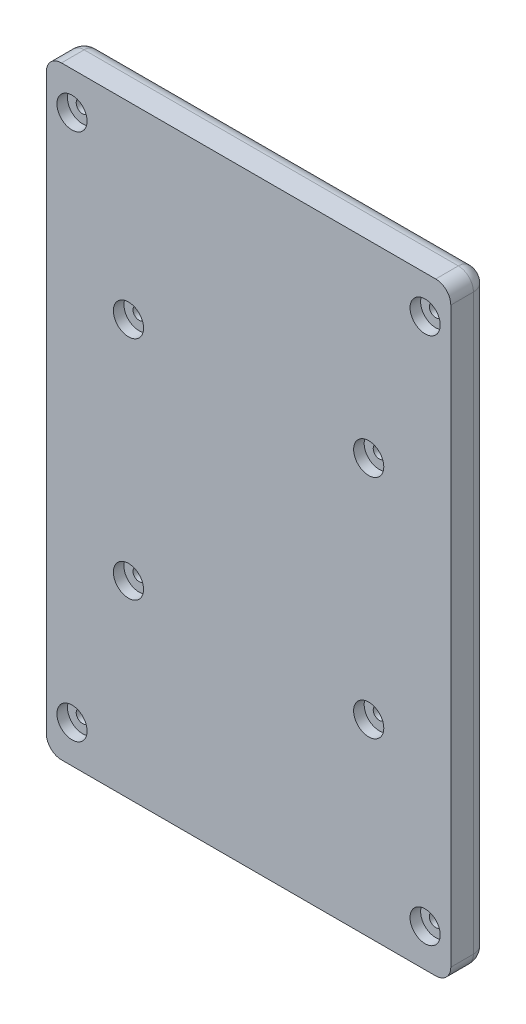
ISO-10303-21;
HEADER;
FILE_DESCRIPTION(('STEP AP214'),'2;1');
FILE_NAME('part.step','',(''),(''),'','','');
FILE_SCHEMA(('AUTOMOTIVE_DESIGN { 1 0 10303 214 1 1 1 1 }'));
ENDSEC;
DATA;
#1=APPLICATION_CONTEXT('core data for automotive mechanical design processes');
#2=APPLICATION_PROTOCOL_DEFINITION('international standard','automotive_design',2000,#1);
#3=PRODUCT_CONTEXT('',#1,'mechanical');
#4=PRODUCT('Part','Part','',(#3));
#5=PRODUCT_RELATED_PRODUCT_CATEGORY('part','',(#4));
#6=PRODUCT_DEFINITION_FORMATION('','',#4);
#7=PRODUCT_DEFINITION_CONTEXT('part definition',#1,'design');
#8=PRODUCT_DEFINITION('design','',#6,#7);
#9=PRODUCT_DEFINITION_SHAPE('','',#8);
#10=(LENGTH_UNIT() NAMED_UNIT(*) SI_UNIT(.MILLI.,.METRE.));
#11=(NAMED_UNIT(*) PLANE_ANGLE_UNIT() SI_UNIT($,.RADIAN.));
#12=(NAMED_UNIT(*) SI_UNIT($,.STERADIAN.) SOLID_ANGLE_UNIT());
#13=UNCERTAINTY_MEASURE_WITH_UNIT(LENGTH_MEASURE(1.E-05),#10,'distance_accuracy_value','');
#14=(GEOMETRIC_REPRESENTATION_CONTEXT(3) GLOBAL_UNCERTAINTY_ASSIGNED_CONTEXT((#13)) GLOBAL_UNIT_ASSIGNED_CONTEXT((#10,
#11,#12)) REPRESENTATION_CONTEXT('',''));
#15=CARTESIAN_POINT('',(0.,0.,0.));
#16=DIRECTION('',(0.,0.,1.));
#17=DIRECTION('',(1.,0.,0.));
#18=AXIS2_PLACEMENT_3D('',#15,#16,#17);
#19=CARTESIAN_POINT('',(54.4050000000001,125.,25.));
#20=DIRECTION('',(0.,0.,-1.));
#21=DIRECTION('',(-1.,0.,0.));
#22=AXIS2_PLACEMENT_3D('',#19,#20,#21);
#23=CYLINDRICAL_SURFACE('',#22,4.00000000000001);
#24=CARTESIAN_POINT('',(54.4050000000001,125.,0.));
#25=DIRECTION('',(0.,0.,1.));
#26=DIRECTION('',(1.,0.,0.));
#27=AXIS2_PLACEMENT_3D('',#24,#25,#26);
#28=CIRCLE('',#27,4.00000000000001);
#29=CARTESIAN_POINT('',(58.4050000000001,125.,0.));
#30=VERTEX_POINT('',#29);
#31=EDGE_CURVE('E240',#30,#30,#28,.T.);
#32=ORIENTED_EDGE('',*,*,#31,.F.);
#33=EDGE_LOOP('',(#32));
#34=FACE_BOUND('',#33,.T.);
#35=CARTESIAN_POINT('',(54.4050000000001,125.,18.));
#36=DIRECTION('',(0.,0.,1.));
#37=DIRECTION('',(1.,0.,0.));
#38=AXIS2_PLACEMENT_3D('',#35,#36,#37);
#39=CIRCLE('',#38,4.00000000000001);
#40=CARTESIAN_POINT('',(58.4050000000001,125.,18.));
#41=VERTEX_POINT('',#40);
#42=EDGE_CURVE('E215',#41,#41,#39,.T.);
#43=ORIENTED_EDGE('',*,*,#42,.T.);
#44=EDGE_LOOP('',(#43));
#45=FACE_BOUND('',#44,.T.);
#46=ADVANCED_FACE('F34',(#34,#45),#23,.F.);
#47=CARTESIAN_POINT('',(213.605,125.,25.));
#48=DIRECTION('',(0.,0.,-1.));
#49=DIRECTION('',(-1.,0.,0.));
#50=AXIS2_PLACEMENT_3D('',#47,#48,#49);
#51=CYLINDRICAL_SURFACE('',#50,3.99999999999999);
#52=CARTESIAN_POINT('',(213.605,125.,0.));
#53=DIRECTION('',(0.,0.,1.));
#54=DIRECTION('',(1.,0.,0.));
#55=AXIS2_PLACEMENT_3D('',#52,#53,#54);
#56=CIRCLE('',#55,3.99999999999999);
#57=CARTESIAN_POINT('',(217.605,125.,0.));
#58=VERTEX_POINT('',#57);
#59=EDGE_CURVE('E243',#58,#58,#56,.T.);
#60=ORIENTED_EDGE('',*,*,#59,.F.);
#61=EDGE_LOOP('',(#60));
#62=FACE_BOUND('',#61,.T.);
#63=CARTESIAN_POINT('',(213.605,125.,18.));
#64=DIRECTION('',(0.,0.,1.));
#65=DIRECTION('',(1.,0.,0.));
#66=AXIS2_PLACEMENT_3D('',#63,#64,#65);
#67=CIRCLE('',#66,3.99999999999999);
#68=CARTESIAN_POINT('',(217.605,125.,18.));
#69=VERTEX_POINT('',#68);
#70=EDGE_CURVE('E222',#69,#69,#67,.T.);
#71=ORIENTED_EDGE('',*,*,#70,.T.);
#72=EDGE_LOOP('',(#71));
#73=FACE_BOUND('',#72,.T.);
#74=ADVANCED_FACE('F284',(#62,#73),#51,.F.);
#75=CARTESIAN_POINT('',(213.605,275.,25.));
#76=DIRECTION('',(0.,0.,-1.));
#77=DIRECTION('',(-1.,0.,0.));
#78=AXIS2_PLACEMENT_3D('',#75,#76,#77);
#79=CYLINDRICAL_SURFACE('',#78,3.99999999999999);
#80=CARTESIAN_POINT('',(213.605,275.,0.));
#81=DIRECTION('',(0.,0.,1.));
#82=DIRECTION('',(1.,0.,0.));
#83=AXIS2_PLACEMENT_3D('',#80,#81,#82);
#84=CIRCLE('',#83,3.99999999999999);
#85=CARTESIAN_POINT('',(217.605,275.,0.));
#86=VERTEX_POINT('',#85);
#87=EDGE_CURVE('E246',#86,#86,#84,.T.);
#88=ORIENTED_EDGE('',*,*,#87,.F.);
#89=EDGE_LOOP('',(#88));
#90=FACE_BOUND('',#89,.T.);
#91=CARTESIAN_POINT('',(213.605,275.,18.));
#92=DIRECTION('',(0.,0.,1.));
#93=DIRECTION('',(1.,0.,0.));
#94=AXIS2_PLACEMENT_3D('',#91,#92,#93);
#95=CIRCLE('',#94,3.99999999999999);
#96=CARTESIAN_POINT('',(217.605,275.,18.));
#97=VERTEX_POINT('',#96);
#98=EDGE_CURVE('E229',#97,#97,#95,.T.);
#99=ORIENTED_EDGE('',*,*,#98,.T.);
#100=EDGE_LOOP('',(#99));
#101=FACE_BOUND('',#100,.T.);
#102=ADVANCED_FACE('F290',(#90,#101),#79,.F.);
#103=CARTESIAN_POINT('',(54.405,275.,25.));
#104=DIRECTION('',(0.,0.,-1.));
#105=DIRECTION('',(-1.,0.,0.));
#106=AXIS2_PLACEMENT_3D('',#103,#104,#105);
#107=CYLINDRICAL_SURFACE('',#106,4.00000000000001);
#108=CARTESIAN_POINT('',(54.405,275.,0.));
#109=DIRECTION('',(0.,0.,1.));
#110=DIRECTION('',(1.,0.,0.));
#111=AXIS2_PLACEMENT_3D('',#108,#109,#110);
#112=CIRCLE('',#111,4.00000000000001);
#113=CARTESIAN_POINT('',(58.405,275.,0.));
#114=VERTEX_POINT('',#113);
#115=EDGE_CURVE('E249',#114,#114,#112,.T.);
#116=ORIENTED_EDGE('',*,*,#115,.F.);
#117=EDGE_LOOP('',(#116));
#118=FACE_BOUND('',#117,.T.);
#119=CARTESIAN_POINT('',(54.405,275.,18.));
#120=DIRECTION('',(0.,0.,1.));
#121=DIRECTION('',(1.,0.,0.));
#122=AXIS2_PLACEMENT_3D('',#119,#120,#121);
#123=CIRCLE('',#122,4.00000000000001);
#124=CARTESIAN_POINT('',(58.405,275.,18.));
#125=VERTEX_POINT('',#124);
#126=EDGE_CURVE('E236',#125,#125,#123,.T.);
#127=ORIENTED_EDGE('',*,*,#126,.T.);
#128=EDGE_LOOP('',(#127));
#129=FACE_BOUND('',#128,.T.);
#130=ADVANCED_FACE('F300',(#118,#129),#107,.F.);
#131=CARTESIAN_POINT('',(0.,0.,25.));
#132=DIRECTION('',(0.,0.,-1.));
#133=DIRECTION('',(-1.,0.,0.));
#134=AXIS2_PLACEMENT_3D('',#131,#132,#133);
#135=PLANE('',#134);
#136=CARTESIAN_POINT('',(17.,25.,25.));
#137=DIRECTION('',(0.,0.,1.));
#138=DIRECTION('',(1.,0.,0.));
#139=AXIS2_PLACEMENT_3D('',#136,#137,#138);
#140=CIRCLE('',#139,9.99999999999999);
#141=CARTESIAN_POINT('',(27.,25.,25.));
#142=VERTEX_POINT('',#141);
#143=EDGE_CURVE('E710',#142,#142,#140,.T.);
#144=ORIENTED_EDGE('',*,*,#143,.F.);
#145=EDGE_LOOP('',(#144));
#146=FACE_BOUND('',#145,.T.);
#147=CARTESIAN_POINT('',(251.,25.,25.));
#148=DIRECTION('',(0.,0.,1.));
#149=DIRECTION('',(1.,0.,0.));
#150=AXIS2_PLACEMENT_3D('',#147,#148,#149);
#151=CIRCLE('',#150,10.);
#152=CARTESIAN_POINT('',(261.,25.,25.));
#153=VERTEX_POINT('',#152);
#154=EDGE_CURVE('E714',#153,#153,#151,.T.);
#155=ORIENTED_EDGE('',*,*,#154,.F.);
#156=EDGE_LOOP('',(#155));
#157=FACE_BOUND('',#156,.T.);
#158=CARTESIAN_POINT('',(251.,375.,25.));
#159=DIRECTION('',(0.,0.,1.));
#160=DIRECTION('',(1.,0.,0.));
#161=AXIS2_PLACEMENT_3D('',#158,#159,#160);
#162=CIRCLE('',#161,9.99999999999998);
#163=CARTESIAN_POINT('',(261.,375.,25.));
#164=VERTEX_POINT('',#163);
#165=EDGE_CURVE('E720',#164,#164,#162,.T.);
#166=ORIENTED_EDGE('',*,*,#165,.F.);
#167=EDGE_LOOP('',(#166));
#168=FACE_BOUND('',#167,.T.);
#169=CARTESIAN_POINT('',(17.,375.,25.));
#170=DIRECTION('',(0.,0.,1.));
#171=DIRECTION('',(1.,0.,0.));
#172=AXIS2_PLACEMENT_3D('',#169,#170,#171);
#173=CIRCLE('',#172,10.);
#174=CARTESIAN_POINT('',(27.,375.,25.));
#175=VERTEX_POINT('',#174);
#176=EDGE_CURVE('E726',#175,#175,#173,.T.);
#177=ORIENTED_EDGE('',*,*,#176,.F.);
#178=EDGE_LOOP('',(#177));
#179=FACE_BOUND('',#178,.T.);
#180=CARTESIAN_POINT('',(54.4050000000001,125.,25.));
#181=DIRECTION('',(0.,0.,1.));
#182=DIRECTION('',(1.,0.,0.));
#183=AXIS2_PLACEMENT_3D('',#180,#181,#182);
#184=CIRCLE('',#183,10.);
#185=CARTESIAN_POINT('',(64.4050000000001,125.,25.));
#186=VERTEX_POINT('',#185);
#187=EDGE_CURVE('E205',#186,#186,#184,.T.);
#188=ORIENTED_EDGE('',*,*,#187,.F.);
#189=EDGE_LOOP('',(#188));
#190=FACE_BOUND('',#189,.T.);
#191=CARTESIAN_POINT('',(213.605,125.,25.));
#192=DIRECTION('',(0.,0.,1.));
#193=DIRECTION('',(1.,0.,0.));
#194=AXIS2_PLACEMENT_3D('',#191,#192,#193);
#195=CIRCLE('',#194,10.);
#196=CARTESIAN_POINT('',(223.605,125.,25.));
#197=VERTEX_POINT('',#196);
#198=EDGE_CURVE('E223',#197,#197,#195,.T.);
#199=ORIENTED_EDGE('',*,*,#198,.F.);
#200=EDGE_LOOP('',(#199));
#201=FACE_BOUND('',#200,.T.);
#202=CARTESIAN_POINT('',(213.605,275.,25.));
#203=DIRECTION('',(0.,0.,1.));
#204=DIRECTION('',(1.,0.,0.));
#205=AXIS2_PLACEMENT_3D('',#202,#203,#204);
#206=CIRCLE('',#205,10.);
#207=CARTESIAN_POINT('',(223.605,275.,25.));
#208=VERTEX_POINT('',#207);
#209=EDGE_CURVE('E230',#208,#208,#206,.T.);
#210=ORIENTED_EDGE('',*,*,#209,.F.);
#211=EDGE_LOOP('',(#210));
#212=FACE_BOUND('',#211,.T.);
#213=CARTESIAN_POINT('',(54.405,275.,25.));
#214=DIRECTION('',(0.,0.,1.));
#215=DIRECTION('',(1.,0.,0.));
#216=AXIS2_PLACEMENT_3D('',#213,#214,#215);
#217=CIRCLE('',#216,10.);
#218=CARTESIAN_POINT('',(64.405,275.,25.));
#219=VERTEX_POINT('',#218);
#220=EDGE_CURVE('E237',#219,#219,#217,.T.);
#221=ORIENTED_EDGE('',*,*,#220,.F.);
#222=EDGE_LOOP('',(#221));
#223=FACE_BOUND('',#222,.T.);
#224=DIRECTION('',(1.,0.,0.));
#225=VECTOR('',#224,1.);
#226=CARTESIAN_POINT('',(0.,0.,25.));
#227=LINE('',#226,#225);
#228=CARTESIAN_POINT('',(10.,0.,25.));
#229=VERTEX_POINT('',#228);
#230=CARTESIAN_POINT('',(258.,0.,25.));
#231=VERTEX_POINT('',#230);
#232=EDGE_CURVE('E119',#229,#231,#227,.T.);
#233=ORIENTED_EDGE('',*,*,#232,.T.);
#234=CARTESIAN_POINT('',(258.,10.,25.));
#235=DIRECTION('',(0.,0.,-1.));
#236=DIRECTION('',(-1.,0.,0.));
#237=AXIS2_PLACEMENT_3D('',#234,#235,#236);
#238=CIRCLE('',#237,10.);
#239=CARTESIAN_POINT('',(268.,10.,25.));
#240=VERTEX_POINT('',#239);
#241=EDGE_CURVE('E113',#231,#240,#238,.F.);
#242=ORIENTED_EDGE('',*,*,#241,.T.);
#243=DIRECTION('',(0.,1.,0.));
#244=VECTOR('',#243,1.);
#245=CARTESIAN_POINT('',(268.,0.,25.));
#246=LINE('',#245,#244);
#247=CARTESIAN_POINT('',(268.,390.,25.));
#248=VERTEX_POINT('',#247);
#249=EDGE_CURVE('E116',#240,#248,#246,.T.);
#250=ORIENTED_EDGE('',*,*,#249,.T.);
#251=CARTESIAN_POINT('',(258.,390.,25.));
#252=DIRECTION('',(0.,0.,-1.));
#253=DIRECTION('',(-1.,0.,0.));
#254=AXIS2_PLACEMENT_3D('',#251,#252,#253);
#255=CIRCLE('',#254,10.);
#256=CARTESIAN_POINT('',(258.,400.,25.));
#257=VERTEX_POINT('',#256);
#258=EDGE_CURVE('E149',#248,#257,#255,.F.);
#259=ORIENTED_EDGE('',*,*,#258,.T.);
#260=DIRECTION('',(-1.,0.,0.));
#261=VECTOR('',#260,1.);
#262=CARTESIAN_POINT('',(0.,400.,25.));
#263=LINE('',#262,#261);
#264=CARTESIAN_POINT('',(9.99999999999995,400.,25.));
#265=VERTEX_POINT('',#264);
#266=EDGE_CURVE('E133',#257,#265,#263,.T.);
#267=ORIENTED_EDGE('',*,*,#266,.T.);
#268=CARTESIAN_POINT('',(9.99999999999995,390.,25.));
#269=DIRECTION('',(0.,0.,-1.));
#270=DIRECTION('',(-1.,0.,0.));
#271=AXIS2_PLACEMENT_3D('',#268,#269,#270);
#272=CIRCLE('',#271,10.);
#273=CARTESIAN_POINT('',(0.,390.,25.));
#274=VERTEX_POINT('',#273);
#275=EDGE_CURVE('E147',#265,#274,#272,.F.);
#276=ORIENTED_EDGE('',*,*,#275,.T.);
#277=DIRECTION('',(0.,-1.,0.));
#278=VECTOR('',#277,1.);
#279=CARTESIAN_POINT('',(0.,0.,25.));
#280=LINE('',#279,#278);
#281=CARTESIAN_POINT('',(0.,10.,25.));
#282=VERTEX_POINT('',#281);
#283=EDGE_CURVE('E252',#274,#282,#280,.T.);
#284=ORIENTED_EDGE('',*,*,#283,.T.);
#285=CARTESIAN_POINT('',(10.,10.,25.));
#286=DIRECTION('',(0.,0.,-1.));
#287=DIRECTION('',(-1.,0.,0.));
#288=AXIS2_PLACEMENT_3D('',#285,#286,#287);
#289=CIRCLE('',#288,10.);
#290=EDGE_CURVE('E124',#282,#229,#289,.F.);
#291=ORIENTED_EDGE('',*,*,#290,.T.);
#292=EDGE_LOOP('',(#233,#242,#250,#259,#267,#276,#284,#291));
#293=FACE_BOUND('',#292,.T.);
#294=ADVANCED_FACE('F115',(#146,#157,#168,#179,#190,#201,#212,#223,#293),#135,.F.);
#295=CARTESIAN_POINT('',(0.,0.,0.));
#296=DIRECTION('',(0.,0.,-1.));
#297=DIRECTION('',(-1.,0.,0.));
#298=AXIS2_PLACEMENT_3D('',#295,#296,#297);
#299=PLANE('',#298);
#300=CARTESIAN_POINT('',(17.,25.,0.));
#301=DIRECTION('',(0.,0.,-1.));
#302=DIRECTION('',(-1.,0.,0.));
#303=AXIS2_PLACEMENT_3D('',#300,#301,#302);
#304=CIRCLE('',#303,4.21639999999999);
#305=CARTESIAN_POINT('',(12.7836,25.,0.));
#306=VERTEX_POINT('',#305);
#307=EDGE_CURVE('E688',#306,#306,#304,.T.);
#308=ORIENTED_EDGE('',*,*,#307,.F.);
#309=EDGE_LOOP('',(#308));
#310=FACE_BOUND('',#309,.T.);
#311=CARTESIAN_POINT('',(251.,25.,0.));
#312=DIRECTION('',(0.,0.,-1.));
#313=DIRECTION('',(-1.,0.,0.));
#314=AXIS2_PLACEMENT_3D('',#311,#312,#313);
#315=CIRCLE('',#314,4.21640000000001);
#316=CARTESIAN_POINT('',(246.7836,25.,0.));
#317=VERTEX_POINT('',#316);
#318=EDGE_CURVE('E692',#317,#317,#315,.T.);
#319=ORIENTED_EDGE('',*,*,#318,.F.);
#320=EDGE_LOOP('',(#319));
#321=FACE_BOUND('',#320,.T.);
#322=CARTESIAN_POINT('',(251.,375.,0.));
#323=DIRECTION('',(0.,0.,-1.));
#324=DIRECTION('',(-1.,0.,0.));
#325=AXIS2_PLACEMENT_3D('',#322,#323,#324);
#326=CIRCLE('',#325,4.21640000000001);
#327=CARTESIAN_POINT('',(246.7836,375.,0.));
#328=VERTEX_POINT('',#327);
#329=EDGE_CURVE('E701',#328,#328,#326,.T.);
#330=ORIENTED_EDGE('',*,*,#329,.F.);
#331=EDGE_LOOP('',(#330));
#332=FACE_BOUND('',#331,.T.);
#333=CARTESIAN_POINT('',(17.,375.,0.));
#334=DIRECTION('',(0.,0.,-1.));
#335=DIRECTION('',(-1.,0.,0.));
#336=AXIS2_PLACEMENT_3D('',#333,#334,#335);
#337=CIRCLE('',#336,4.21639999999999);
#338=CARTESIAN_POINT('',(12.7836,375.,0.));
#339=VERTEX_POINT('',#338);
#340=EDGE_CURVE('E707',#339,#339,#337,.T.);
#341=ORIENTED_EDGE('',*,*,#340,.F.);
#342=EDGE_LOOP('',(#341));
#343=FACE_BOUND('',#342,.T.);
#344=DIRECTION('',(-1.,0.,0.));
#345=VECTOR('',#344,1.);
#346=CARTESIAN_POINT('',(258.,390.,0.));
#347=LINE('',#346,#345);
#348=CARTESIAN_POINT('',(9.99999999999995,390.,0.));
#349=VERTEX_POINT('',#348);
#350=CARTESIAN_POINT('',(258.,390.,0.));
#351=VERTEX_POINT('',#350);
#352=EDGE_CURVE('E164',#349,#351,#347,.F.);
#353=ORIENTED_EDGE('',*,*,#352,.T.);
#354=DIRECTION('',(0.,1.,0.));
#355=VECTOR('',#354,1.);
#356=CARTESIAN_POINT('',(258.,10.,0.));
#357=LINE('',#356,#355);
#358=CARTESIAN_POINT('',(258.,10.,0.));
#359=VERTEX_POINT('',#358);
#360=EDGE_CURVE('E170',#351,#359,#357,.F.);
#361=ORIENTED_EDGE('',*,*,#360,.T.);
#362=DIRECTION('',(1.,0.,0.));
#363=VECTOR('',#362,1.);
#364=CARTESIAN_POINT('',(10.,10.,0.));
#365=LINE('',#364,#363);
#366=CARTESIAN_POINT('',(10.,10.,0.));
#367=VERTEX_POINT('',#366);
#368=EDGE_CURVE('E168',#359,#367,#365,.F.);
#369=ORIENTED_EDGE('',*,*,#368,.T.);
#370=DIRECTION('',(0.,-1.,0.));
#371=VECTOR('',#370,1.);
#372=CARTESIAN_POINT('',(9.99999999999995,390.,0.));
#373=LINE('',#372,#371);
#374=EDGE_CURVE('E166',#367,#349,#373,.F.);
#375=ORIENTED_EDGE('',*,*,#374,.T.);
#376=EDGE_LOOP('',(#353,#361,#369,#375));
#377=FACE_BOUND('',#376,.T.);
#378=ORIENTED_EDGE('',*,*,#59,.T.);
#379=EDGE_LOOP('',(#378));
#380=FACE_BOUND('',#379,.T.);
#381=ORIENTED_EDGE('',*,*,#115,.T.);
#382=EDGE_LOOP('',(#381));
#383=FACE_BOUND('',#382,.T.);
#384=ORIENTED_EDGE('',*,*,#87,.T.);
#385=EDGE_LOOP('',(#384));
#386=FACE_BOUND('',#385,.T.);
#387=ORIENTED_EDGE('',*,*,#31,.T.);
#388=EDGE_LOOP('',(#387));
#389=FACE_BOUND('',#388,.T.);
#390=ADVANCED_FACE('F307',(#310,#321,#332,#343,#377,#380,#383,#386,#389),#299,.T.);
#391=CARTESIAN_POINT('',(0.,0.,25.));
#392=DIRECTION('',(1.,0.,0.));
#393=DIRECTION('',(0.,1.,0.));
#394=AXIS2_PLACEMENT_3D('',#391,#392,#393);
#395=PLANE('',#394);
#396=DIRECTION('',(0.,0.,-1.));
#397=VECTOR('',#396,1.);
#398=CARTESIAN_POINT('',(0.,390.,25.));
#399=LINE('',#398,#397);
#400=CARTESIAN_POINT('',(0.,390.,10.));
#401=VERTEX_POINT('',#400);
#402=EDGE_CURVE('E123',#274,#401,#399,.T.);
#403=ORIENTED_EDGE('',*,*,#402,.T.);
#404=DIRECTION('',(0.,-1.,0.));
#405=VECTOR('',#404,1.);
#406=CARTESIAN_POINT('',(0.,10.,10.));
#407=LINE('',#406,#405);
#408=CARTESIAN_POINT('',(0.,10.,10.));
#409=VERTEX_POINT('',#408);
#410=EDGE_CURVE('E178',#401,#409,#407,.T.);
#411=ORIENTED_EDGE('',*,*,#410,.T.);
#412=DIRECTION('',(0.,0.,-1.));
#413=VECTOR('',#412,1.);
#414=CARTESIAN_POINT('',(0.,10.,25.));
#415=LINE('',#414,#413);
#416=EDGE_CURVE('E153',#409,#282,#415,.F.);
#417=ORIENTED_EDGE('',*,*,#416,.T.);
#418=ORIENTED_EDGE('',*,*,#283,.F.);
#419=EDGE_LOOP('',(#403,#411,#417,#418));
#420=FACE_BOUND('',#419,.T.);
#421=ADVANCED_FACE('F311',(#420),#395,.F.);
#422=CARTESIAN_POINT('',(0.,0.,25.));
#423=DIRECTION('',(0.,1.,0.));
#424=DIRECTION('',(0.,0.,1.));
#425=AXIS2_PLACEMENT_3D('',#422,#423,#424);
#426=PLANE('',#425);
#427=DIRECTION('',(0.,0.,-1.));
#428=VECTOR('',#427,1.);
#429=CARTESIAN_POINT('',(10.,0.,25.));
#430=LINE('',#429,#428);
#431=CARTESIAN_POINT('',(10.,0.,10.));
#432=VERTEX_POINT('',#431);
#433=EDGE_CURVE('E138',#229,#432,#430,.T.);
#434=ORIENTED_EDGE('',*,*,#433,.T.);
#435=DIRECTION('',(1.,0.,0.));
#436=VECTOR('',#435,1.);
#437=CARTESIAN_POINT('',(258.,0.,10.));
#438=LINE('',#437,#436);
#439=CARTESIAN_POINT('',(258.,0.,10.));
#440=VERTEX_POINT('',#439);
#441=EDGE_CURVE('E174',#432,#440,#438,.T.);
#442=ORIENTED_EDGE('',*,*,#441,.T.);
#443=DIRECTION('',(0.,0.,-1.));
#444=VECTOR('',#443,1.);
#445=CARTESIAN_POINT('',(258.,0.,25.));
#446=LINE('',#445,#444);
#447=EDGE_CURVE('E141',#440,#231,#446,.F.);
#448=ORIENTED_EDGE('',*,*,#447,.T.);
#449=ORIENTED_EDGE('',*,*,#232,.F.);
#450=EDGE_LOOP('',(#434,#442,#448,#449));
#451=FACE_BOUND('',#450,.T.);
#452=ADVANCED_FACE('F318',(#451),#426,.F.);
#453=CARTESIAN_POINT('',(268.,0.,25.));
#454=DIRECTION('',(-1.,0.,0.));
#455=DIRECTION('',(0.,-1.,0.));
#456=AXIS2_PLACEMENT_3D('',#453,#454,#455);
#457=PLANE('',#456);
#458=DIRECTION('',(0.,0.,-1.));
#459=VECTOR('',#458,1.);
#460=CARTESIAN_POINT('',(268.,10.,25.));
#461=LINE('',#460,#459);
#462=CARTESIAN_POINT('',(268.,10.,10.));
#463=VERTEX_POINT('',#462);
#464=EDGE_CURVE('E129',#240,#463,#461,.T.);
#465=ORIENTED_EDGE('',*,*,#464,.T.);
#466=DIRECTION('',(0.,1.,0.));
#467=VECTOR('',#466,1.);
#468=CARTESIAN_POINT('',(268.,390.,10.));
#469=LINE('',#468,#467);
#470=CARTESIAN_POINT('',(268.,390.,10.));
#471=VERTEX_POINT('',#470);
#472=EDGE_CURVE('E162',#463,#471,#469,.T.);
#473=ORIENTED_EDGE('',*,*,#472,.T.);
#474=DIRECTION('',(0.,0.,-1.));
#475=VECTOR('',#474,1.);
#476=CARTESIAN_POINT('',(268.,390.,25.));
#477=LINE('',#476,#475);
#478=EDGE_CURVE('E132',#471,#248,#477,.F.);
#479=ORIENTED_EDGE('',*,*,#478,.T.);
#480=ORIENTED_EDGE('',*,*,#249,.F.);
#481=EDGE_LOOP('',(#465,#473,#479,#480));
#482=FACE_BOUND('',#481,.T.);
#483=ADVANCED_FACE('F128',(#482),#457,.F.);
#484=CARTESIAN_POINT('',(0.,400.,25.));
#485=DIRECTION('',(0.,-1.,0.));
#486=DIRECTION('',(1.,0.,0.));
#487=AXIS2_PLACEMENT_3D('',#484,#485,#486);
#488=PLANE('',#487);
#489=DIRECTION('',(0.,0.,-1.));
#490=VECTOR('',#489,1.);
#491=CARTESIAN_POINT('',(258.,400.,25.));
#492=LINE('',#491,#490);
#493=CARTESIAN_POINT('',(258.,400.,10.));
#494=VERTEX_POINT('',#493);
#495=EDGE_CURVE('E157',#257,#494,#492,.T.);
#496=ORIENTED_EDGE('',*,*,#495,.T.);
#497=DIRECTION('',(-1.,0.,0.));
#498=VECTOR('',#497,1.);
#499=CARTESIAN_POINT('',(9.99999999999995,400.,10.));
#500=LINE('',#499,#498);
#501=CARTESIAN_POINT('',(9.99999999999995,400.,10.));
#502=VERTEX_POINT('',#501);
#503=EDGE_CURVE('E11',#494,#502,#500,.T.);
#504=ORIENTED_EDGE('',*,*,#503,.T.);
#505=DIRECTION('',(0.,0.,-1.));
#506=VECTOR('',#505,1.);
#507=CARTESIAN_POINT('',(9.99999999999995,400.,25.));
#508=LINE('',#507,#506);
#509=EDGE_CURVE('E155',#502,#265,#508,.F.);
#510=ORIENTED_EDGE('',*,*,#509,.T.);
#511=ORIENTED_EDGE('',*,*,#266,.F.);
#512=EDGE_LOOP('',(#496,#504,#510,#511));
#513=FACE_BOUND('',#512,.T.);
#514=ADVANCED_FACE('F313',(#513),#488,.F.);
#515=CARTESIAN_POINT('',(54.405,275.,18.));
#516=DIRECTION('',(0.,0.,1.));
#517=DIRECTION('',(1.,0.,0.));
#518=AXIS2_PLACEMENT_3D('',#515,#516,#517);
#519=CYLINDRICAL_SURFACE('',#518,10.);
#520=CARTESIAN_POINT('',(54.405,275.,18.));
#521=DIRECTION('',(0.,0.,1.));
#522=DIRECTION('',(1.,0.,0.));
#523=AXIS2_PLACEMENT_3D('',#520,#521,#522);
#524=CIRCLE('',#523,10.);
#525=CARTESIAN_POINT('',(64.405,275.,18.));
#526=VERTEX_POINT('',#525);
#527=EDGE_CURVE('E233',#526,#526,#524,.T.);
#528=ORIENTED_EDGE('',*,*,#527,.F.);
#529=EDGE_LOOP('',(#528));
#530=FACE_BOUND('',#529,.T.);
#531=ORIENTED_EDGE('',*,*,#220,.T.);
#532=EDGE_LOOP('',(#531));
#533=FACE_BOUND('',#532,.T.);
#534=ADVANCED_FACE('F295',(#530,#533),#519,.F.);
#535=CARTESIAN_POINT('',(54.405,275.,18.));
#536=DIRECTION('',(0.,0.,1.));
#537=DIRECTION('',(1.,0.,0.));
#538=AXIS2_PLACEMENT_3D('',#535,#536,#537);
#539=PLANE('',#538);
#540=ORIENTED_EDGE('',*,*,#126,.F.);
#541=EDGE_LOOP('',(#540));
#542=FACE_BOUND('',#541,.T.);
#543=ORIENTED_EDGE('',*,*,#527,.T.);
#544=EDGE_LOOP('',(#543));
#545=FACE_BOUND('',#544,.T.);
#546=ADVANCED_FACE('F406',(#542,#545),#539,.T.);
#547=CARTESIAN_POINT('',(213.605,275.,18.));
#548=DIRECTION('',(0.,0.,1.));
#549=DIRECTION('',(1.,0.,0.));
#550=AXIS2_PLACEMENT_3D('',#547,#548,#549);
#551=CYLINDRICAL_SURFACE('',#550,10.);
#552=CARTESIAN_POINT('',(213.605,275.,18.));
#553=DIRECTION('',(0.,0.,1.));
#554=DIRECTION('',(1.,0.,0.));
#555=AXIS2_PLACEMENT_3D('',#552,#553,#554);
#556=CIRCLE('',#555,10.);
#557=CARTESIAN_POINT('',(223.605,275.,18.));
#558=VERTEX_POINT('',#557);
#559=EDGE_CURVE('E226',#558,#558,#556,.T.);
#560=ORIENTED_EDGE('',*,*,#559,.F.);
#561=EDGE_LOOP('',(#560));
#562=FACE_BOUND('',#561,.T.);
#563=ORIENTED_EDGE('',*,*,#209,.T.);
#564=EDGE_LOOP('',(#563));
#565=FACE_BOUND('',#564,.T.);
#566=ADVANCED_FACE('F400',(#562,#565),#551,.F.);
#567=CARTESIAN_POINT('',(213.605,275.,18.));
#568=DIRECTION('',(0.,0.,1.));
#569=DIRECTION('',(1.,0.,0.));
#570=AXIS2_PLACEMENT_3D('',#567,#568,#569);
#571=PLANE('',#570);
#572=ORIENTED_EDGE('',*,*,#98,.F.);
#573=EDGE_LOOP('',(#572));
#574=FACE_BOUND('',#573,.T.);
#575=ORIENTED_EDGE('',*,*,#559,.T.);
#576=EDGE_LOOP('',(#575));
#577=FACE_BOUND('',#576,.T.);
#578=ADVANCED_FACE('F397',(#574,#577),#571,.T.);
#579=CARTESIAN_POINT('',(213.605,125.,18.));
#580=DIRECTION('',(0.,0.,1.));
#581=DIRECTION('',(1.,0.,0.));
#582=AXIS2_PLACEMENT_3D('',#579,#580,#581);
#583=CYLINDRICAL_SURFACE('',#582,10.);
#584=CARTESIAN_POINT('',(213.605,125.,18.));
#585=DIRECTION('',(0.,0.,1.));
#586=DIRECTION('',(1.,0.,0.));
#587=AXIS2_PLACEMENT_3D('',#584,#585,#586);
#588=CIRCLE('',#587,10.);
#589=CARTESIAN_POINT('',(223.605,125.,18.));
#590=VERTEX_POINT('',#589);
#591=EDGE_CURVE('E219',#590,#590,#588,.T.);
#592=ORIENTED_EDGE('',*,*,#591,.F.);
#593=EDGE_LOOP('',(#592));
#594=FACE_BOUND('',#593,.T.);
#595=ORIENTED_EDGE('',*,*,#198,.T.);
#596=EDGE_LOOP('',(#595));
#597=FACE_BOUND('',#596,.T.);
#598=ADVANCED_FACE('F280',(#594,#597),#583,.F.);
#599=CARTESIAN_POINT('',(213.605,125.,18.));
#600=DIRECTION('',(0.,0.,1.));
#601=DIRECTION('',(1.,0.,0.));
#602=AXIS2_PLACEMENT_3D('',#599,#600,#601);
#603=PLANE('',#602);
#604=ORIENTED_EDGE('',*,*,#70,.F.);
#605=EDGE_LOOP('',(#604));
#606=FACE_BOUND('',#605,.T.);
#607=ORIENTED_EDGE('',*,*,#591,.T.);
#608=EDGE_LOOP('',(#607));
#609=FACE_BOUND('',#608,.T.);
#610=ADVANCED_FACE('F275',(#606,#609),#603,.T.);
#611=CARTESIAN_POINT('',(54.4050000000001,125.,18.));
#612=DIRECTION('',(0.,0.,1.));
#613=DIRECTION('',(1.,0.,0.));
#614=AXIS2_PLACEMENT_3D('',#611,#612,#613);
#615=CYLINDRICAL_SURFACE('',#614,10.);
#616=CARTESIAN_POINT('',(54.4050000000001,125.,18.));
#617=DIRECTION('',(0.,0.,1.));
#618=DIRECTION('',(1.,0.,0.));
#619=AXIS2_PLACEMENT_3D('',#616,#617,#618);
#620=CIRCLE('',#619,10.);
#621=CARTESIAN_POINT('',(64.4050000000001,125.,18.));
#622=VERTEX_POINT('',#621);
#623=EDGE_CURVE('E210',#622,#622,#620,.T.);
#624=ORIENTED_EDGE('',*,*,#623,.F.);
#625=EDGE_LOOP('',(#624));
#626=FACE_BOUND('',#625,.T.);
#627=ORIENTED_EDGE('',*,*,#187,.T.);
#628=EDGE_LOOP('',(#627));
#629=FACE_BOUND('',#628,.T.);
#630=ADVANCED_FACE('F270',(#626,#629),#615,.F.);
#631=CARTESIAN_POINT('',(54.4050000000001,125.,18.));
#632=DIRECTION('',(0.,0.,1.));
#633=DIRECTION('',(1.,0.,0.));
#634=AXIS2_PLACEMENT_3D('',#631,#632,#633);
#635=PLANE('',#634);
#636=ORIENTED_EDGE('',*,*,#42,.F.);
#637=EDGE_LOOP('',(#636));
#638=FACE_BOUND('',#637,.T.);
#639=ORIENTED_EDGE('',*,*,#623,.T.);
#640=EDGE_LOOP('',(#639));
#641=FACE_BOUND('',#640,.T.);
#642=ADVANCED_FACE('F267',(#638,#641),#635,.T.);
#643=CARTESIAN_POINT('',(258.,10.,25.));
#644=DIRECTION('',(0.,0.,-1.));
#645=DIRECTION('',(-1.,0.,0.));
#646=AXIS2_PLACEMENT_3D('',#643,#644,#645);
#647=CYLINDRICAL_SURFACE('',#646,10.);
#648=ORIENTED_EDGE('',*,*,#447,.F.);
#649=CARTESIAN_POINT('',(258.,10.,10.));
#650=DIRECTION('',(0.,0.,-1.));
#651=DIRECTION('',(-1.,0.,0.));
#652=AXIS2_PLACEMENT_3D('',#649,#650,#651);
#653=CIRCLE('',#652,10.);
#654=EDGE_CURVE('E137',#440,#463,#653,.F.);
#655=ORIENTED_EDGE('',*,*,#654,.T.);
#656=ORIENTED_EDGE('',*,*,#464,.F.);
#657=ORIENTED_EDGE('',*,*,#241,.F.);
#658=EDGE_LOOP('',(#648,#655,#656,#657));
#659=FACE_BOUND('',#658,.T.);
#660=ADVANCED_FACE('F135',(#659),#647,.T.);
#661=CARTESIAN_POINT('',(10.,10.,25.));
#662=DIRECTION('',(0.,0.,-1.));
#663=DIRECTION('',(-1.,0.,0.));
#664=AXIS2_PLACEMENT_3D('',#661,#662,#663);
#665=CYLINDRICAL_SURFACE('',#664,10.);
#666=ORIENTED_EDGE('',*,*,#416,.F.);
#667=CARTESIAN_POINT('',(10.,10.,10.));
#668=DIRECTION('',(0.,0.,-1.));
#669=DIRECTION('',(-1.,0.,0.));
#670=AXIS2_PLACEMENT_3D('',#667,#668,#669);
#671=CIRCLE('',#670,10.);
#672=EDGE_CURVE('E176',#409,#432,#671,.F.);
#673=ORIENTED_EDGE('',*,*,#672,.T.);
#674=ORIENTED_EDGE('',*,*,#433,.F.);
#675=ORIENTED_EDGE('',*,*,#290,.F.);
#676=EDGE_LOOP('',(#666,#673,#674,#675));
#677=FACE_BOUND('',#676,.T.);
#678=ADVANCED_FACE('F327',(#677),#665,.T.);
#679=CARTESIAN_POINT('',(258.,390.,25.));
#680=DIRECTION('',(0.,0.,-1.));
#681=DIRECTION('',(-1.,0.,0.));
#682=AXIS2_PLACEMENT_3D('',#679,#680,#681);
#683=CYLINDRICAL_SURFACE('',#682,10.);
#684=ORIENTED_EDGE('',*,*,#478,.F.);
#685=CARTESIAN_POINT('',(258.,390.,10.));
#686=DIRECTION('',(0.,0.,-1.));
#687=DIRECTION('',(-1.,0.,0.));
#688=AXIS2_PLACEMENT_3D('',#685,#686,#687);
#689=CIRCLE('',#688,10.);
#690=EDGE_CURVE('E159',#471,#494,#689,.F.);
#691=ORIENTED_EDGE('',*,*,#690,.T.);
#692=ORIENTED_EDGE('',*,*,#495,.F.);
#693=ORIENTED_EDGE('',*,*,#258,.F.);
#694=EDGE_LOOP('',(#684,#691,#692,#693));
#695=FACE_BOUND('',#694,.T.);
#696=ADVANCED_FACE('F330',(#695),#683,.T.);
#697=CARTESIAN_POINT('',(9.99999999999995,390.,25.));
#698=DIRECTION('',(0.,0.,-1.));
#699=DIRECTION('',(-1.,0.,0.));
#700=AXIS2_PLACEMENT_3D('',#697,#698,#699);
#701=CYLINDRICAL_SURFACE('',#700,10.);
#702=ORIENTED_EDGE('',*,*,#509,.F.);
#703=CARTESIAN_POINT('',(9.99999999999995,390.,10.));
#704=DIRECTION('',(0.,0.,-1.));
#705=DIRECTION('',(-1.,0.,0.));
#706=AXIS2_PLACEMENT_3D('',#703,#704,#705);
#707=CIRCLE('',#706,10.);
#708=EDGE_CURVE('E43',#502,#401,#707,.F.);
#709=ORIENTED_EDGE('',*,*,#708,.T.);
#710=ORIENTED_EDGE('',*,*,#402,.F.);
#711=ORIENTED_EDGE('',*,*,#275,.F.);
#712=EDGE_LOOP('',(#702,#709,#710,#711));
#713=FACE_BOUND('',#712,.T.);
#714=ADVANCED_FACE('F334',(#713),#701,.T.);
#715=CARTESIAN_POINT('',(10.,10.,10.));
#716=DIRECTION('',(0.,0.,-1.));
#717=DIRECTION('',(-1.,0.,0.));
#718=AXIS2_PLACEMENT_3D('',#715,#716,#717);
#719=SPHERICAL_SURFACE('',#718,10.);
#720=CARTESIAN_POINT('',(10.,10.,10.));
#721=DIRECTION('',(1.,0.,0.));
#722=DIRECTION('',(0.,0.,-1.));
#723=AXIS2_PLACEMENT_3D('',#720,#721,#722);
#724=CIRCLE('',#723,10.);
#725=EDGE_CURVE('E197',#432,#367,#724,.T.);
#726=ORIENTED_EDGE('',*,*,#725,.F.);
#727=ORIENTED_EDGE('',*,*,#672,.F.);
#728=CARTESIAN_POINT('',(10.,10.,10.));
#729=DIRECTION('',(0.,1.,0.));
#730=DIRECTION('',(-1.,0.,0.));
#731=AXIS2_PLACEMENT_3D('',#728,#729,#730);
#732=CIRCLE('',#731,10.);
#733=EDGE_CURVE('E38',#367,#409,#732,.T.);
#734=ORIENTED_EDGE('',*,*,#733,.F.);
#735=EDGE_LOOP('',(#726,#727,#734));
#736=FACE_BOUND('',#735,.T.);
#737=ADVANCED_FACE('F36',(#736),#719,.T.);
#738=CARTESIAN_POINT('',(10.,0.,10.));
#739=DIRECTION('',(0.,1.,0.));
#740=DIRECTION('',(-1.,0.,0.));
#741=AXIS2_PLACEMENT_3D('',#738,#739,#740);
#742=CYLINDRICAL_SURFACE('',#741,10.);
#743=ORIENTED_EDGE('',*,*,#733,.T.);
#744=ORIENTED_EDGE('',*,*,#410,.F.);
#745=CARTESIAN_POINT('',(9.99999999999995,390.,10.));
#746=DIRECTION('',(0.,1.,0.));
#747=DIRECTION('',(0.,0.,1.));
#748=AXIS2_PLACEMENT_3D('',#745,#746,#747);
#749=CIRCLE('',#748,10.);
#750=EDGE_CURVE('E195',#349,#401,#749,.T.);
#751=ORIENTED_EDGE('',*,*,#750,.F.);
#752=ORIENTED_EDGE('',*,*,#374,.F.);
#753=EDGE_LOOP('',(#743,#744,#751,#752));
#754=FACE_BOUND('',#753,.T.);
#755=ADVANCED_FACE('F361',(#754),#742,.T.);
#756=CARTESIAN_POINT('',(0.,10.,10.));
#757=DIRECTION('',(-1.,0.,0.));
#758=DIRECTION('',(0.,0.,1.));
#759=AXIS2_PLACEMENT_3D('',#756,#757,#758);
#760=CYLINDRICAL_SURFACE('',#759,10.);
#761=ORIENTED_EDGE('',*,*,#725,.T.);
#762=ORIENTED_EDGE('',*,*,#368,.F.);
#763=CARTESIAN_POINT('',(258.,10.,10.));
#764=DIRECTION('',(1.,0.,0.));
#765=DIRECTION('',(0.,0.,-1.));
#766=AXIS2_PLACEMENT_3D('',#763,#764,#765);
#767=CIRCLE('',#766,10.);
#768=EDGE_CURVE('E192',#440,#359,#767,.T.);
#769=ORIENTED_EDGE('',*,*,#768,.F.);
#770=ORIENTED_EDGE('',*,*,#441,.F.);
#771=EDGE_LOOP('',(#761,#762,#769,#770));
#772=FACE_BOUND('',#771,.T.);
#773=ADVANCED_FACE('F358',(#772),#760,.T.);
#774=CARTESIAN_POINT('',(9.99999999999995,390.,10.));
#775=DIRECTION('',(0.,0.,-1.));
#776=DIRECTION('',(-1.,0.,0.));
#777=AXIS2_PLACEMENT_3D('',#774,#775,#776);
#778=SPHERICAL_SURFACE('',#777,10.);
#779=ORIENTED_EDGE('',*,*,#750,.T.);
#780=ORIENTED_EDGE('',*,*,#708,.F.);
#781=CARTESIAN_POINT('',(9.99999999999995,390.,10.));
#782=DIRECTION('',(1.,0.,0.));
#783=DIRECTION('',(0.,1.,0.));
#784=AXIS2_PLACEMENT_3D('',#781,#782,#783);
#785=CIRCLE('',#784,10.);
#786=EDGE_CURVE('E189',#349,#502,#785,.T.);
#787=ORIENTED_EDGE('',*,*,#786,.F.);
#788=EDGE_LOOP('',(#779,#780,#787));
#789=FACE_BOUND('',#788,.T.);
#790=ADVANCED_FACE('F354',(#789),#778,.T.);
#791=CARTESIAN_POINT('',(258.,10.,10.));
#792=DIRECTION('',(0.,0.,-1.));
#793=DIRECTION('',(-1.,0.,0.));
#794=AXIS2_PLACEMENT_3D('',#791,#792,#793);
#795=SPHERICAL_SURFACE('',#794,10.);
#796=ORIENTED_EDGE('',*,*,#654,.F.);
#797=ORIENTED_EDGE('',*,*,#768,.T.);
#798=CARTESIAN_POINT('',(258.,10.,10.));
#799=DIRECTION('',(0.,1.,0.));
#800=DIRECTION('',(-1.,0.,0.));
#801=AXIS2_PLACEMENT_3D('',#798,#799,#800);
#802=CIRCLE('',#801,10.);
#803=EDGE_CURVE('E187',#463,#359,#802,.T.);
#804=ORIENTED_EDGE('',*,*,#803,.F.);
#805=EDGE_LOOP('',(#796,#797,#804));
#806=FACE_BOUND('',#805,.T.);
#807=ADVANCED_FACE('F350',(#806),#795,.T.);
#808=CARTESIAN_POINT('',(0.,390.,10.));
#809=DIRECTION('',(1.,0.,0.));
#810=DIRECTION('',(0.,1.,0.));
#811=AXIS2_PLACEMENT_3D('',#808,#809,#810);
#812=CYLINDRICAL_SURFACE('',#811,10.);
#813=ORIENTED_EDGE('',*,*,#786,.T.);
#814=ORIENTED_EDGE('',*,*,#503,.F.);
#815=CARTESIAN_POINT('',(258.,390.,10.));
#816=DIRECTION('',(1.,0.,0.));
#817=DIRECTION('',(0.,0.,-1.));
#818=AXIS2_PLACEMENT_3D('',#815,#816,#817);
#819=CIRCLE('',#818,10.);
#820=EDGE_CURVE('E184',#351,#494,#819,.T.);
#821=ORIENTED_EDGE('',*,*,#820,.F.);
#822=ORIENTED_EDGE('',*,*,#352,.F.);
#823=EDGE_LOOP('',(#813,#814,#821,#822));
#824=FACE_BOUND('',#823,.T.);
#825=ADVANCED_FACE('F346',(#824),#812,.T.);
#826=CARTESIAN_POINT('',(258.,0.,10.));
#827=DIRECTION('',(0.,-1.,0.));
#828=DIRECTION('',(1.,0.,0.));
#829=AXIS2_PLACEMENT_3D('',#826,#827,#828);
#830=CYLINDRICAL_SURFACE('',#829,10.);
#831=ORIENTED_EDGE('',*,*,#803,.T.);
#832=ORIENTED_EDGE('',*,*,#360,.F.);
#833=CARTESIAN_POINT('',(258.,390.,10.));
#834=DIRECTION('',(0.,1.,0.));
#835=DIRECTION('',(0.,0.,1.));
#836=AXIS2_PLACEMENT_3D('',#833,#834,#835);
#837=CIRCLE('',#836,10.);
#838=EDGE_CURVE('E181',#471,#351,#837,.T.);
#839=ORIENTED_EDGE('',*,*,#838,.F.);
#840=ORIENTED_EDGE('',*,*,#472,.F.);
#841=EDGE_LOOP('',(#831,#832,#839,#840));
#842=FACE_BOUND('',#841,.T.);
#843=ADVANCED_FACE('F342',(#842),#830,.T.);
#844=CARTESIAN_POINT('',(258.,390.,10.));
#845=DIRECTION('',(0.,0.,-1.));
#846=DIRECTION('',(-1.,0.,0.));
#847=AXIS2_PLACEMENT_3D('',#844,#845,#846);
#848=SPHERICAL_SURFACE('',#847,10.);
#849=ORIENTED_EDGE('',*,*,#820,.T.);
#850=ORIENTED_EDGE('',*,*,#690,.F.);
#851=ORIENTED_EDGE('',*,*,#838,.T.);
#852=EDGE_LOOP('',(#849,#850,#851));
#853=FACE_BOUND('',#852,.T.);
#854=ADVANCED_FACE('F338',(#853),#848,.T.);
#855=CARTESIAN_POINT('',(17.,375.,18.));
#856=DIRECTION('',(0.,0.,1.));
#857=DIRECTION('',(1.,0.,0.));
#858=AXIS2_PLACEMENT_3D('',#855,#856,#857);
#859=CYLINDRICAL_SURFACE('',#858,10.);
#860=CARTESIAN_POINT('',(17.,375.,18.));
#861=DIRECTION('',(0.,0.,1.));
#862=DIRECTION('',(1.,0.,0.));
#863=AXIS2_PLACEMENT_3D('',#860,#861,#862);
#864=CIRCLE('',#863,10.);
#865=CARTESIAN_POINT('',(27.,375.,18.));
#866=VERTEX_POINT('',#865);
#867=EDGE_CURVE('E185',#866,#866,#864,.T.);
#868=ORIENTED_EDGE('',*,*,#867,.F.);
#869=EDGE_LOOP('',(#868));
#870=FACE_BOUND('',#869,.T.);
#871=ORIENTED_EDGE('',*,*,#176,.T.);
#872=EDGE_LOOP('',(#871));
#873=FACE_BOUND('',#872,.T.);
#874=ADVANCED_FACE('F341',(#870,#873),#859,.F.);
#875=CARTESIAN_POINT('',(17.,375.,18.));
#876=DIRECTION('',(0.,0.,1.));
#877=DIRECTION('',(1.,0.,0.));
#878=AXIS2_PLACEMENT_3D('',#875,#876,#877);
#879=PLANE('',#878);
#880=CARTESIAN_POINT('',(17.,375.,18.));
#881=DIRECTION('',(0.,0.,1.));
#882=DIRECTION('',(1.,0.,0.));
#883=AXIS2_PLACEMENT_3D('',#880,#881,#882);
#884=CIRCLE('',#883,4.21639999999999);
#885=CARTESIAN_POINT('',(21.2163999999999,375.,18.));
#886=VERTEX_POINT('',#885);
#887=EDGE_CURVE('E704',#886,#886,#884,.T.);
#888=ORIENTED_EDGE('',*,*,#887,.F.);
#889=EDGE_LOOP('',(#888));
#890=FACE_BOUND('',#889,.T.);
#891=ORIENTED_EDGE('',*,*,#867,.T.);
#892=EDGE_LOOP('',(#891));
#893=FACE_BOUND('',#892,.T.);
#894=ADVANCED_FACE('F563',(#890,#893),#879,.T.);
#895=CARTESIAN_POINT('',(251.,375.,18.));
#896=DIRECTION('',(0.,0.,1.));
#897=DIRECTION('',(1.,0.,0.));
#898=AXIS2_PLACEMENT_3D('',#895,#896,#897);
#899=CYLINDRICAL_SURFACE('',#898,9.99999999999998);
#900=CARTESIAN_POINT('',(251.,375.,18.));
#901=DIRECTION('',(0.,0.,1.));
#902=DIRECTION('',(1.,0.,0.));
#903=AXIS2_PLACEMENT_3D('',#900,#901,#902);
#904=CIRCLE('',#903,9.99999999999998);
#905=CARTESIAN_POINT('',(261.,375.,18.));
#906=VERTEX_POINT('',#905);
#907=EDGE_CURVE('E723',#906,#906,#904,.T.);
#908=ORIENTED_EDGE('',*,*,#907,.F.);
#909=EDGE_LOOP('',(#908));
#910=FACE_BOUND('',#909,.T.);
#911=ORIENTED_EDGE('',*,*,#165,.T.);
#912=EDGE_LOOP('',(#911));
#913=FACE_BOUND('',#912,.T.);
#914=ADVANCED_FACE('F571',(#910,#913),#899,.F.);
#915=CARTESIAN_POINT('',(251.,375.,18.));
#916=DIRECTION('',(0.,0.,1.));
#917=DIRECTION('',(1.,0.,0.));
#918=AXIS2_PLACEMENT_3D('',#915,#916,#917);
#919=PLANE('',#918);
#920=CARTESIAN_POINT('',(251.,375.,18.));
#921=DIRECTION('',(0.,0.,1.));
#922=DIRECTION('',(1.,0.,0.));
#923=AXIS2_PLACEMENT_3D('',#920,#921,#922);
#924=CIRCLE('',#923,4.21640000000001);
#925=CARTESIAN_POINT('',(255.2164,375.,18.));
#926=VERTEX_POINT('',#925);
#927=EDGE_CURVE('E698',#926,#926,#924,.T.);
#928=ORIENTED_EDGE('',*,*,#927,.F.);
#929=EDGE_LOOP('',(#928));
#930=FACE_BOUND('',#929,.T.);
#931=ORIENTED_EDGE('',*,*,#907,.T.);
#932=EDGE_LOOP('',(#931));
#933=FACE_BOUND('',#932,.T.);
#934=ADVANCED_FACE('F576',(#930,#933),#919,.T.);
#935=CARTESIAN_POINT('',(251.,25.,18.));
#936=DIRECTION('',(0.,0.,1.));
#937=DIRECTION('',(1.,0.,0.));
#938=AXIS2_PLACEMENT_3D('',#935,#936,#937);
#939=CYLINDRICAL_SURFACE('',#938,10.);
#940=CARTESIAN_POINT('',(251.,25.,18.));
#941=DIRECTION('',(0.,0.,1.));
#942=DIRECTION('',(1.,0.,0.));
#943=AXIS2_PLACEMENT_3D('',#940,#941,#942);
#944=CIRCLE('',#943,10.);
#945=CARTESIAN_POINT('',(261.,25.,18.));
#946=VERTEX_POINT('',#945);
#947=EDGE_CURVE('E717',#946,#946,#944,.T.);
#948=ORIENTED_EDGE('',*,*,#947,.F.);
#949=EDGE_LOOP('',(#948));
#950=FACE_BOUND('',#949,.T.);
#951=ORIENTED_EDGE('',*,*,#154,.T.);
#952=EDGE_LOOP('',(#951));
#953=FACE_BOUND('',#952,.T.);
#954=ADVANCED_FACE('F584',(#950,#953),#939,.F.);
#955=CARTESIAN_POINT('',(251.,25.,18.));
#956=DIRECTION('',(0.,0.,1.));
#957=DIRECTION('',(1.,0.,0.));
#958=AXIS2_PLACEMENT_3D('',#955,#956,#957);
#959=PLANE('',#958);
#960=CARTESIAN_POINT('',(251.,25.,18.));
#961=DIRECTION('',(0.,0.,1.));
#962=DIRECTION('',(1.,0.,0.));
#963=AXIS2_PLACEMENT_3D('',#960,#961,#962);
#964=CIRCLE('',#963,4.21640000000001);
#965=CARTESIAN_POINT('',(255.2164,25.,18.));
#966=VERTEX_POINT('',#965);
#967=EDGE_CURVE('E689',#966,#966,#964,.T.);
#968=ORIENTED_EDGE('',*,*,#967,.F.);
#969=EDGE_LOOP('',(#968));
#970=FACE_BOUND('',#969,.T.);
#971=ORIENTED_EDGE('',*,*,#947,.T.);
#972=EDGE_LOOP('',(#971));
#973=FACE_BOUND('',#972,.T.);
#974=ADVANCED_FACE('F589',(#970,#973),#959,.T.);
#975=CARTESIAN_POINT('',(17.,25.,18.));
#976=DIRECTION('',(0.,0.,1.));
#977=DIRECTION('',(1.,0.,0.));
#978=AXIS2_PLACEMENT_3D('',#975,#976,#977);
#979=CYLINDRICAL_SURFACE('',#978,9.99999999999999);
#980=CARTESIAN_POINT('',(17.,25.,18.));
#981=DIRECTION('',(0.,0.,1.));
#982=DIRECTION('',(1.,0.,0.));
#983=AXIS2_PLACEMENT_3D('',#980,#981,#982);
#984=CIRCLE('',#983,9.99999999999999);
#985=CARTESIAN_POINT('',(27.,25.,18.));
#986=VERTEX_POINT('',#985);
#987=EDGE_CURVE('E711',#986,#986,#984,.T.);
#988=ORIENTED_EDGE('',*,*,#987,.F.);
#989=EDGE_LOOP('',(#988));
#990=FACE_BOUND('',#989,.T.);
#991=ORIENTED_EDGE('',*,*,#143,.T.);
#992=EDGE_LOOP('',(#991));
#993=FACE_BOUND('',#992,.T.);
#994=ADVANCED_FACE('F597',(#990,#993),#979,.F.);
#995=CARTESIAN_POINT('',(17.,25.,18.));
#996=DIRECTION('',(0.,0.,1.));
#997=DIRECTION('',(1.,0.,0.));
#998=AXIS2_PLACEMENT_3D('',#995,#996,#997);
#999=PLANE('',#998);
#1000=CARTESIAN_POINT('',(17.,25.,18.));
#1001=DIRECTION('',(0.,0.,1.));
#1002=DIRECTION('',(1.,0.,0.));
#1003=AXIS2_PLACEMENT_3D('',#1000,#1001,#1002);
#1004=CIRCLE('',#1003,4.21639999999999);
#1005=CARTESIAN_POINT('',(21.2164,25.,18.));
#1006=VERTEX_POINT('',#1005);
#1007=EDGE_CURVE('E685',#1006,#1006,#1004,.T.);
#1008=ORIENTED_EDGE('',*,*,#1007,.F.);
#1009=EDGE_LOOP('',(#1008));
#1010=FACE_BOUND('',#1009,.T.);
#1011=ORIENTED_EDGE('',*,*,#987,.T.);
#1012=EDGE_LOOP('',(#1011));
#1013=FACE_BOUND('',#1012,.T.);
#1014=ADVANCED_FACE('F602',(#1010,#1013),#999,.T.);
#1015=CARTESIAN_POINT('',(17.,375.,18.));
#1016=DIRECTION('',(0.,0.,1.));
#1017=DIRECTION('',(1.,0.,0.));
#1018=AXIS2_PLACEMENT_3D('',#1015,#1016,#1017);
#1019=CYLINDRICAL_SURFACE('',#1018,4.21639999999999);
#1020=ORIENTED_EDGE('',*,*,#887,.T.);
#1021=EDGE_LOOP('',(#1020));
#1022=FACE_BOUND('',#1021,.T.);
#1023=ORIENTED_EDGE('',*,*,#340,.T.);
#1024=EDGE_LOOP('',(#1023));
#1025=FACE_BOUND('',#1024,.T.);
#1026=ADVANCED_FACE('F638',(#1022,#1025),#1019,.F.);
#1027=CARTESIAN_POINT('',(251.,375.,18.));
#1028=DIRECTION('',(0.,0.,1.));
#1029=DIRECTION('',(1.,0.,0.));
#1030=AXIS2_PLACEMENT_3D('',#1027,#1028,#1029);
#1031=CYLINDRICAL_SURFACE('',#1030,4.21640000000001);
#1032=ORIENTED_EDGE('',*,*,#927,.T.);
#1033=EDGE_LOOP('',(#1032));
#1034=FACE_BOUND('',#1033,.T.);
#1035=ORIENTED_EDGE('',*,*,#329,.T.);
#1036=EDGE_LOOP('',(#1035));
#1037=FACE_BOUND('',#1036,.T.);
#1038=ADVANCED_FACE('F648',(#1034,#1037),#1031,.F.);
#1039=CARTESIAN_POINT('',(251.,25.,18.));
#1040=DIRECTION('',(0.,0.,1.));
#1041=DIRECTION('',(1.,0.,0.));
#1042=AXIS2_PLACEMENT_3D('',#1039,#1040,#1041);
#1043=CYLINDRICAL_SURFACE('',#1042,4.21640000000001);
#1044=ORIENTED_EDGE('',*,*,#967,.T.);
#1045=EDGE_LOOP('',(#1044));
#1046=FACE_BOUND('',#1045,.T.);
#1047=ORIENTED_EDGE('',*,*,#318,.T.);
#1048=EDGE_LOOP('',(#1047));
#1049=FACE_BOUND('',#1048,.T.);
#1050=ADVANCED_FACE('F658',(#1046,#1049),#1043,.F.);
#1051=CARTESIAN_POINT('',(17.,25.,18.));
#1052=DIRECTION('',(0.,0.,1.));
#1053=DIRECTION('',(1.,0.,0.));
#1054=AXIS2_PLACEMENT_3D('',#1051,#1052,#1053);
#1055=CYLINDRICAL_SURFACE('',#1054,4.21639999999999);
#1056=ORIENTED_EDGE('',*,*,#1007,.T.);
#1057=EDGE_LOOP('',(#1056));
#1058=FACE_BOUND('',#1057,.T.);
#1059=ORIENTED_EDGE('',*,*,#307,.T.);
#1060=EDGE_LOOP('',(#1059));
#1061=FACE_BOUND('',#1060,.T.);
#1062=ADVANCED_FACE('F668',(#1058,#1061),#1055,.F.);
#1063=CLOSED_SHELL('',(#46,#74,#102,#130,#294,#390,#421,#452,#483,#514,#534,#546,#566,#578,#598,
#610,#630,#642,#660,#678,#696,#714,#737,#755,#773,#790,#807,#825,#843,#854,#874,#894,#914,#934,
#954,#974,#994,#1014,#1026,#1038,#1050,#1062));
#1064=MANIFOLD_SOLID_BREP('B2',#1063);
#1065=ADVANCED_BREP_SHAPE_REPRESENTATION('',(#18,#1064),#14);
#1066=SHAPE_DEFINITION_REPRESENTATION(#9,#1065);
ENDSEC;
END-ISO-10303-21;
